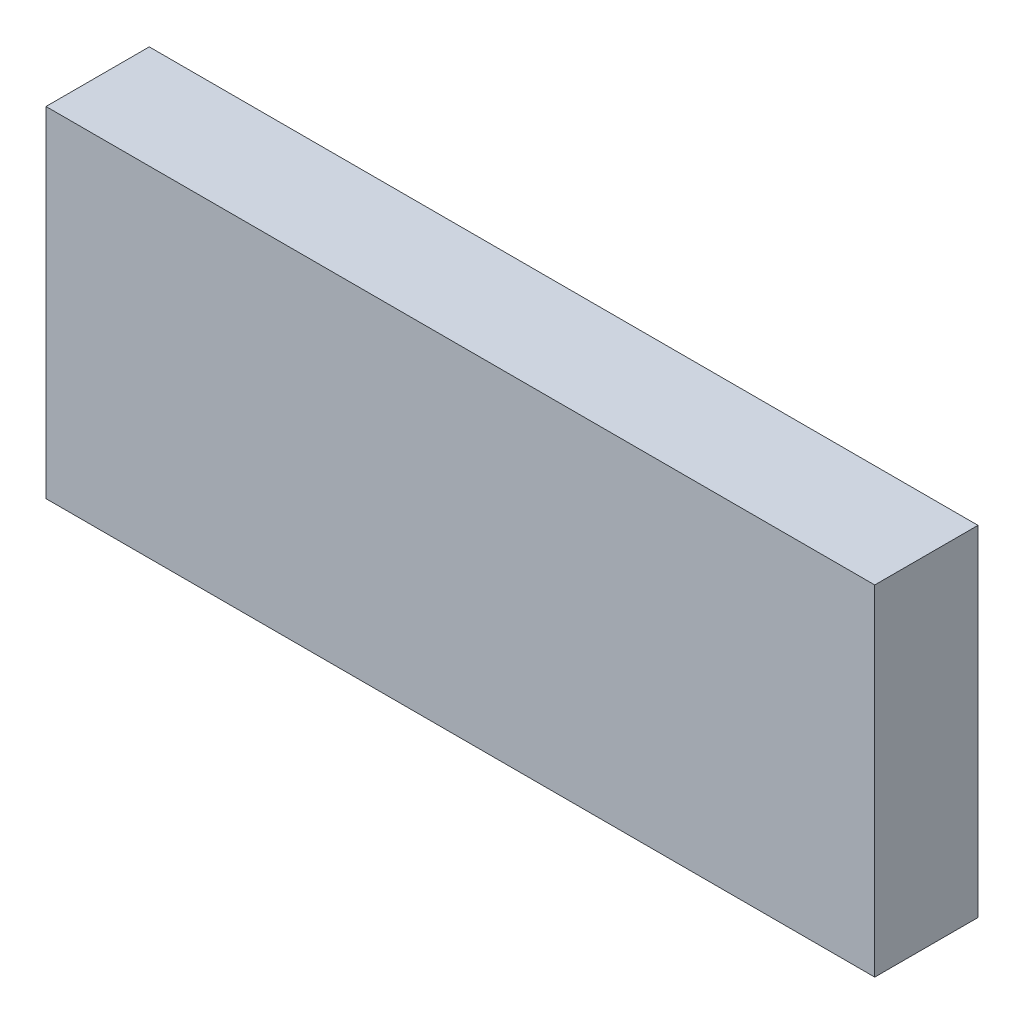
ISO-10303-21;
HEADER;
FILE_DESCRIPTION(('STEP AP214'),'2;1');
FILE_NAME('part.step','',(''),(''),'','','');
FILE_SCHEMA(('AUTOMOTIVE_DESIGN { 1 0 10303 214 1 1 1 1 }'));
ENDSEC;
DATA;
#1=APPLICATION_CONTEXT('core data for automotive mechanical design processes');
#2=APPLICATION_PROTOCOL_DEFINITION('international standard','automotive_design',2000,#1);
#3=PRODUCT_CONTEXT('',#1,'mechanical');
#4=PRODUCT('Part','Part','',(#3));
#5=PRODUCT_RELATED_PRODUCT_CATEGORY('part','',(#4));
#6=PRODUCT_DEFINITION_FORMATION('','',#4);
#7=PRODUCT_DEFINITION_CONTEXT('part definition',#1,'design');
#8=PRODUCT_DEFINITION('design','',#6,#7);
#9=PRODUCT_DEFINITION_SHAPE('','',#8);
#10=(LENGTH_UNIT() NAMED_UNIT(*) SI_UNIT(.MILLI.,.METRE.));
#11=(NAMED_UNIT(*) PLANE_ANGLE_UNIT() SI_UNIT($,.RADIAN.));
#12=(NAMED_UNIT(*) SI_UNIT($,.STERADIAN.) SOLID_ANGLE_UNIT());
#13=UNCERTAINTY_MEASURE_WITH_UNIT(LENGTH_MEASURE(1.E-05),#10,'distance_accuracy_value','');
#14=(GEOMETRIC_REPRESENTATION_CONTEXT(3) GLOBAL_UNCERTAINTY_ASSIGNED_CONTEXT((#13)) GLOBAL_UNIT_ASSIGNED_CONTEXT((#10,
#11,#12)) REPRESENTATION_CONTEXT('',''));
#15=CARTESIAN_POINT('',(0.,0.,0.));
#16=DIRECTION('',(0.,0.,1.));
#17=DIRECTION('',(1.,0.,0.));
#18=AXIS2_PLACEMENT_3D('',#15,#16,#17);
#19=CARTESIAN_POINT('',(1.52500076,-0.62500002,0.38000178));
#20=DIRECTION('',(0.,0.,1.));
#21=DIRECTION('',(1.,0.,0.));
#22=AXIS2_PLACEMENT_3D('',#19,#20,#21);
#23=PLANE('',#22);
#24=DIRECTION('',(0.,-1.,0.));
#25=VECTOR('',#24,1.);
#26=CARTESIAN_POINT('',(1.52500076,0.62500002,0.38000178));
#27=LINE('',#26,#25);
#28=CARTESIAN_POINT('',(1.52500076,0.62500002,0.38000178));
#29=VERTEX_POINT('',#28);
#30=CARTESIAN_POINT('',(1.52500076,-0.62500002,0.38000178));
#31=VERTEX_POINT('',#30);
#32=EDGE_CURVE('E28',#29,#31,#27,.T.);
#33=ORIENTED_EDGE('',*,*,#32,.F.);
#34=DIRECTION('',(1.,0.,0.));
#35=VECTOR('',#34,1.);
#36=CARTESIAN_POINT('',(-1.52499822,0.62500002,0.38000178));
#37=LINE('',#36,#35);
#38=CARTESIAN_POINT('',(-1.52499822,0.62500002,0.38000178));
#39=VERTEX_POINT('',#38);
#40=EDGE_CURVE('E67',#39,#29,#37,.T.);
#41=ORIENTED_EDGE('',*,*,#40,.F.);
#42=DIRECTION('',(0.,1.,0.));
#43=VECTOR('',#42,1.);
#44=CARTESIAN_POINT('',(-1.52499822,-0.62500002,0.38000178));
#45=LINE('',#44,#43);
#46=CARTESIAN_POINT('',(-1.52499822,-0.62500002,0.38000178));
#47=VERTEX_POINT('',#46);
#48=EDGE_CURVE('E21',#47,#39,#45,.T.);
#49=ORIENTED_EDGE('',*,*,#48,.F.);
#50=DIRECTION('',(-1.,0.,0.));
#51=VECTOR('',#50,1.);
#52=CARTESIAN_POINT('',(1.52500076,-0.62500002,0.38000178));
#53=LINE('',#52,#51);
#54=EDGE_CURVE('E87',#31,#47,#53,.T.);
#55=ORIENTED_EDGE('',*,*,#54,.F.);
#56=EDGE_LOOP('',(#33,#41,#49,#55));
#57=FACE_BOUND('',#56,.T.);
#58=ADVANCED_FACE('F17',(#57),#23,.T.);
#59=CARTESIAN_POINT('',(1.52500076,-0.62500002,0.));
#60=DIRECTION('',(0.,0.,1.));
#61=DIRECTION('',(1.,0.,0.));
#62=AXIS2_PLACEMENT_3D('',#59,#60,#61);
#63=PLANE('',#62);
#64=DIRECTION('',(-1.,0.,0.));
#65=VECTOR('',#64,1.);
#66=CARTESIAN_POINT('',(1.52500076,-0.62500002,0.));
#67=LINE('',#66,#65);
#68=CARTESIAN_POINT('',(1.52500076,-0.62500002,0.));
#69=VERTEX_POINT('',#68);
#70=CARTESIAN_POINT('',(-1.52499822,-0.62500002,0.));
#71=VERTEX_POINT('',#70);
#72=EDGE_CURVE('E96',#69,#71,#67,.T.);
#73=ORIENTED_EDGE('',*,*,#72,.T.);
#74=DIRECTION('',(0.,1.,0.));
#75=VECTOR('',#74,1.);
#76=CARTESIAN_POINT('',(-1.52499822,-0.62500002,0.));
#77=LINE('',#76,#75);
#78=CARTESIAN_POINT('',(-1.52499822,0.62500002,0.));
#79=VERTEX_POINT('',#78);
#80=EDGE_CURVE('E109',#71,#79,#77,.T.);
#81=ORIENTED_EDGE('',*,*,#80,.T.);
#82=DIRECTION('',(1.,0.,0.));
#83=VECTOR('',#82,1.);
#84=CARTESIAN_POINT('',(-1.52499822,0.62500002,0.));
#85=LINE('',#84,#83);
#86=CARTESIAN_POINT('',(1.52500076,0.62500002,0.));
#87=VERTEX_POINT('',#86);
#88=EDGE_CURVE('E56',#79,#87,#85,.T.);
#89=ORIENTED_EDGE('',*,*,#88,.T.);
#90=DIRECTION('',(0.,-1.,0.));
#91=VECTOR('',#90,1.);
#92=CARTESIAN_POINT('',(1.52500076,0.62500002,0.));
#93=LINE('',#92,#91);
#94=EDGE_CURVE('E11',#87,#69,#93,.T.);
#95=ORIENTED_EDGE('',*,*,#94,.T.);
#96=EDGE_LOOP('',(#73,#81,#89,#95));
#97=FACE_BOUND('',#96,.T.);
#98=ADVANCED_FACE('F119',(#97),#63,.F.);
#99=CARTESIAN_POINT('',(1.52500076,0.62500002,0.));
#100=DIRECTION('',(1.,0.,0.));
#101=DIRECTION('',(0.,1.,0.));
#102=AXIS2_PLACEMENT_3D('',#99,#100,#101);
#103=PLANE('',#102);
#104=DIRECTION('',(0.,0.,1.));
#105=VECTOR('',#104,1.);
#106=CARTESIAN_POINT('',(1.52500076,0.62500002,0.));
#107=LINE('',#106,#105);
#108=EDGE_CURVE('E83',#87,#29,#107,.T.);
#109=ORIENTED_EDGE('',*,*,#108,.T.);
#110=ORIENTED_EDGE('',*,*,#32,.T.);
#111=DIRECTION('',(0.,0.,1.));
#112=VECTOR('',#111,1.);
#113=CARTESIAN_POINT('',(1.52500076,-0.62500002,0.));
#114=LINE('',#113,#112);
#115=EDGE_CURVE('E82',#69,#31,#114,.T.);
#116=ORIENTED_EDGE('',*,*,#115,.F.);
#117=ORIENTED_EDGE('',*,*,#94,.F.);
#118=EDGE_LOOP('',(#109,#110,#116,#117));
#119=FACE_BOUND('',#118,.T.);
#120=ADVANCED_FACE('F80',(#119),#103,.T.);
#121=CARTESIAN_POINT('',(-1.52499822,0.62500002,0.));
#122=DIRECTION('',(0.,1.,0.));
#123=DIRECTION('',(1.,0.,0.));
#124=AXIS2_PLACEMENT_3D('',#121,#122,#123);
#125=PLANE('',#124);
#126=DIRECTION('',(0.,0.,1.));
#127=VECTOR('',#126,1.);
#128=CARTESIAN_POINT('',(-1.52499822,0.62500002,0.));
#129=LINE('',#128,#127);
#130=EDGE_CURVE('E111',#79,#39,#129,.T.);
#131=ORIENTED_EDGE('',*,*,#130,.T.);
#132=ORIENTED_EDGE('',*,*,#40,.T.);
#133=ORIENTED_EDGE('',*,*,#108,.F.);
#134=ORIENTED_EDGE('',*,*,#88,.F.);
#135=EDGE_LOOP('',(#131,#132,#133,#134));
#136=FACE_BOUND('',#135,.T.);
#137=ADVANCED_FACE('F19',(#136),#125,.T.);
#138=CARTESIAN_POINT('',(-1.52499822,-0.62500002,0.));
#139=DIRECTION('',(-1.,0.,0.));
#140=DIRECTION('',(0.,0.,1.));
#141=AXIS2_PLACEMENT_3D('',#138,#139,#140);
#142=PLANE('',#141);
#143=DIRECTION('',(0.,0.,1.));
#144=VECTOR('',#143,1.);
#145=CARTESIAN_POINT('',(-1.52499822,-0.62500002,0.));
#146=LINE('',#145,#144);
#147=EDGE_CURVE('E91',#71,#47,#146,.T.);
#148=ORIENTED_EDGE('',*,*,#147,.T.);
#149=ORIENTED_EDGE('',*,*,#48,.T.);
#150=ORIENTED_EDGE('',*,*,#130,.F.);
#151=ORIENTED_EDGE('',*,*,#80,.F.);
#152=EDGE_LOOP('',(#148,#149,#150,#151));
#153=FACE_BOUND('',#152,.T.);
#154=ADVANCED_FACE('F116',(#153),#142,.T.);
#155=CARTESIAN_POINT('',(1.52500076,-0.62500002,0.));
#156=DIRECTION('',(0.,-1.,0.));
#157=DIRECTION('',(0.,0.,-1.));
#158=AXIS2_PLACEMENT_3D('',#155,#156,#157);
#159=PLANE('',#158);
#160=ORIENTED_EDGE('',*,*,#115,.T.);
#161=ORIENTED_EDGE('',*,*,#54,.T.);
#162=ORIENTED_EDGE('',*,*,#147,.F.);
#163=ORIENTED_EDGE('',*,*,#72,.F.);
#164=EDGE_LOOP('',(#160,#161,#162,#163));
#165=FACE_BOUND('',#164,.T.);
#166=ADVANCED_FACE('F94',(#165),#159,.T.);
#167=CLOSED_SHELL('',(#58,#98,#120,#137,#154,#166));
#168=MANIFOLD_SOLID_BREP('B1',#167);
#169=ADVANCED_BREP_SHAPE_REPRESENTATION('',(#18,#168),#14);
#170=SHAPE_DEFINITION_REPRESENTATION(#9,#169);
ENDSEC;
END-ISO-10303-21;
